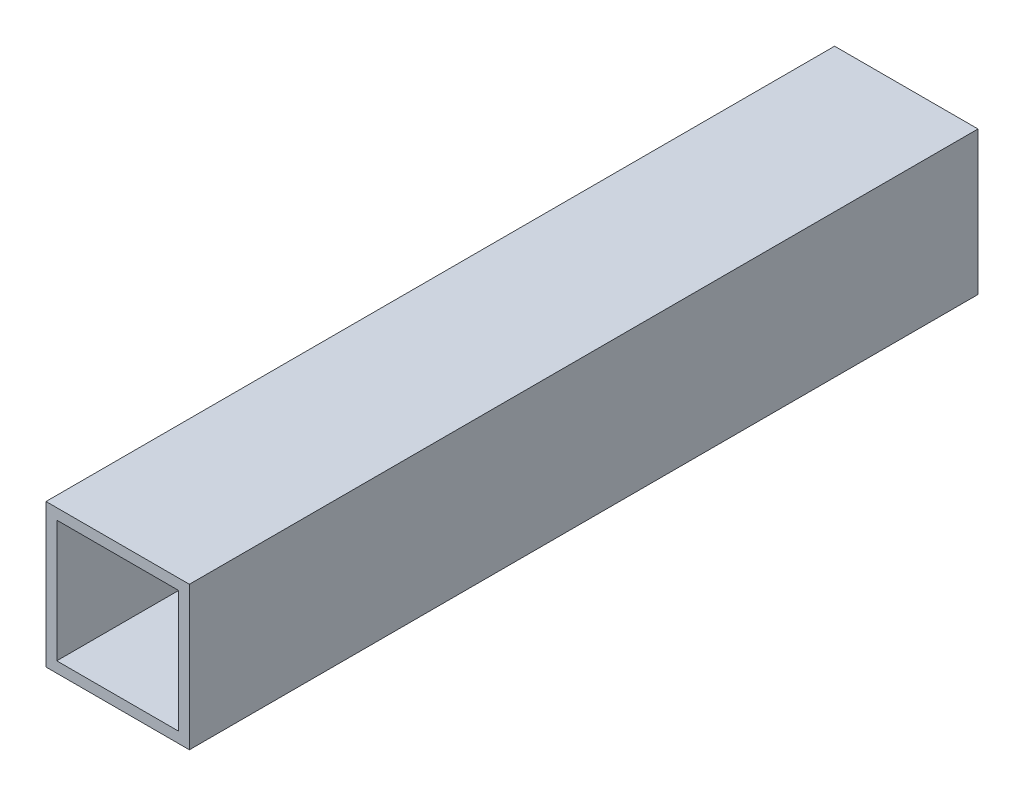
ISO-10303-21;
HEADER;
FILE_DESCRIPTION(('STEP AP214'),'2;1');
FILE_NAME('part.step','',(''),(''),'','','');
FILE_SCHEMA(('AUTOMOTIVE_DESIGN { 1 0 10303 214 1 1 1 1 }'));
ENDSEC;
DATA;
#1=APPLICATION_CONTEXT('core data for automotive mechanical design processes');
#2=APPLICATION_PROTOCOL_DEFINITION('international standard','automotive_design',2000,#1);
#3=PRODUCT_CONTEXT('',#1,'mechanical');
#4=PRODUCT('Part','Part','',(#3));
#5=PRODUCT_RELATED_PRODUCT_CATEGORY('part','',(#4));
#6=PRODUCT_DEFINITION_FORMATION('','',#4);
#7=PRODUCT_DEFINITION_CONTEXT('part definition',#1,'design');
#8=PRODUCT_DEFINITION('design','',#6,#7);
#9=PRODUCT_DEFINITION_SHAPE('','',#8);
#10=(LENGTH_UNIT() NAMED_UNIT(*) SI_UNIT(.MILLI.,.METRE.));
#11=(NAMED_UNIT(*) PLANE_ANGLE_UNIT() SI_UNIT($,.RADIAN.));
#12=(NAMED_UNIT(*) SI_UNIT($,.STERADIAN.) SOLID_ANGLE_UNIT());
#13=UNCERTAINTY_MEASURE_WITH_UNIT(LENGTH_MEASURE(1.E-05),#10,'distance_accuracy_value','');
#14=(GEOMETRIC_REPRESENTATION_CONTEXT(3) GLOBAL_UNCERTAINTY_ASSIGNED_CONTEXT((#13)) GLOBAL_UNIT_ASSIGNED_CONTEXT((#10,
#11,#12)) REPRESENTATION_CONTEXT('',''));
#15=CARTESIAN_POINT('',(0.,0.,0.));
#16=DIRECTION('',(0.,0.,1.));
#17=DIRECTION('',(1.,0.,0.));
#18=AXIS2_PLACEMENT_3D('',#15,#16,#17);
#19=CARTESIAN_POINT('',(0.,0.,220.));
#20=DIRECTION('',(0.,0.,1.));
#21=DIRECTION('',(1.,0.,0.));
#22=AXIS2_PLACEMENT_3D('',#19,#20,#21);
#23=PLANE('',#22);
#24=DIRECTION('',(0.,-1.,0.));
#25=VECTOR('',#24,1.);
#26=CARTESIAN_POINT('',(-20.,-20.,220.));
#27=LINE('',#26,#25);
#28=CARTESIAN_POINT('',(-20.,20.,220.));
#29=VERTEX_POINT('',#28);
#30=CARTESIAN_POINT('',(-20.,-20.,220.));
#31=VERTEX_POINT('',#30);
#32=EDGE_CURVE('E134',#29,#31,#27,.T.);
#33=ORIENTED_EDGE('',*,*,#32,.T.);
#34=DIRECTION('',(1.,0.,0.));
#35=VECTOR('',#34,1.);
#36=CARTESIAN_POINT('',(20.,-20.,220.));
#37=LINE('',#36,#35);
#38=CARTESIAN_POINT('',(20.,-20.,220.));
#39=VERTEX_POINT('',#38);
#40=EDGE_CURVE('E137',#31,#39,#37,.T.);
#41=ORIENTED_EDGE('',*,*,#40,.T.);
#42=DIRECTION('',(0.,1.,0.));
#43=VECTOR('',#42,1.);
#44=CARTESIAN_POINT('',(20.,-20.,220.));
#45=LINE('',#44,#43);
#46=CARTESIAN_POINT('',(20.,20.,220.));
#47=VERTEX_POINT('',#46);
#48=EDGE_CURVE('E140',#39,#47,#45,.T.);
#49=ORIENTED_EDGE('',*,*,#48,.T.);
#50=DIRECTION('',(-1.,0.,0.));
#51=VECTOR('',#50,1.);
#52=CARTESIAN_POINT('',(20.,20.,220.));
#53=LINE('',#52,#51);
#54=EDGE_CURVE('E142',#47,#29,#53,.T.);
#55=ORIENTED_EDGE('',*,*,#54,.T.);
#56=EDGE_LOOP('',(#33,#41,#49,#55));
#57=FACE_BOUND('',#56,.T.);
#58=DIRECTION('',(-1.,0.,0.));
#59=VECTOR('',#58,1.);
#60=CARTESIAN_POINT('',(17.,17.,220.));
#61=LINE('',#60,#59);
#62=CARTESIAN_POINT('',(17.,17.,220.));
#63=VERTEX_POINT('',#62);
#64=CARTESIAN_POINT('',(-17.,17.,220.));
#65=VERTEX_POINT('',#64);
#66=EDGE_CURVE('E106',#63,#65,#61,.T.);
#67=ORIENTED_EDGE('',*,*,#66,.F.);
#68=DIRECTION('',(0.,1.,0.));
#69=VECTOR('',#68,1.);
#70=CARTESIAN_POINT('',(17.,-17.,220.));
#71=LINE('',#70,#69);
#72=CARTESIAN_POINT('',(17.,-17.,220.));
#73=VERTEX_POINT('',#72);
#74=EDGE_CURVE('E98',#73,#63,#71,.T.);
#75=ORIENTED_EDGE('',*,*,#74,.F.);
#76=DIRECTION('',(1.,0.,0.));
#77=VECTOR('',#76,1.);
#78=CARTESIAN_POINT('',(17.,-17.,220.));
#79=LINE('',#78,#77);
#80=CARTESIAN_POINT('',(-17.,-17.,220.));
#81=VERTEX_POINT('',#80);
#82=EDGE_CURVE('E120',#81,#73,#79,.T.);
#83=ORIENTED_EDGE('',*,*,#82,.F.);
#84=DIRECTION('',(0.,-1.,0.));
#85=VECTOR('',#84,1.);
#86=CARTESIAN_POINT('',(-17.,-17.,220.));
#87=LINE('',#86,#85);
#88=EDGE_CURVE('E118',#65,#81,#87,.T.);
#89=ORIENTED_EDGE('',*,*,#88,.F.);
#90=EDGE_LOOP('',(#67,#75,#83,#89));
#91=FACE_BOUND('',#90,.T.);
#92=ADVANCED_FACE('F33',(#57,#91),#23,.T.);
#93=CARTESIAN_POINT('',(0.,0.,0.));
#94=DIRECTION('',(0.,0.,1.));
#95=DIRECTION('',(1.,0.,0.));
#96=AXIS2_PLACEMENT_3D('',#93,#94,#95);
#97=PLANE('',#96);
#98=DIRECTION('',(0.,-1.,0.));
#99=VECTOR('',#98,1.);
#100=CARTESIAN_POINT('',(-20.,-20.,0.));
#101=LINE('',#100,#99);
#102=CARTESIAN_POINT('',(-20.,20.,0.));
#103=VERTEX_POINT('',#102);
#104=CARTESIAN_POINT('',(-20.,-20.,0.));
#105=VERTEX_POINT('',#104);
#106=EDGE_CURVE('E114',#103,#105,#101,.T.);
#107=ORIENTED_EDGE('',*,*,#106,.F.);
#108=DIRECTION('',(-1.,0.,0.));
#109=VECTOR('',#108,1.);
#110=CARTESIAN_POINT('',(20.,20.,0.));
#111=LINE('',#110,#109);
#112=CARTESIAN_POINT('',(20.,20.,0.));
#113=VERTEX_POINT('',#112);
#114=EDGE_CURVE('E138',#113,#103,#111,.T.);
#115=ORIENTED_EDGE('',*,*,#114,.F.);
#116=DIRECTION('',(0.,1.,0.));
#117=VECTOR('',#116,1.);
#118=CARTESIAN_POINT('',(20.,-20.,0.));
#119=LINE('',#118,#117);
#120=CARTESIAN_POINT('',(20.,-20.,0.));
#121=VERTEX_POINT('',#120);
#122=EDGE_CURVE('E149',#121,#113,#119,.T.);
#123=ORIENTED_EDGE('',*,*,#122,.F.);
#124=DIRECTION('',(1.,0.,0.));
#125=VECTOR('',#124,1.);
#126=CARTESIAN_POINT('',(20.,-20.,0.));
#127=LINE('',#126,#125);
#128=EDGE_CURVE('E147',#105,#121,#127,.T.);
#129=ORIENTED_EDGE('',*,*,#128,.F.);
#130=EDGE_LOOP('',(#107,#115,#123,#129));
#131=FACE_BOUND('',#130,.T.);
#132=DIRECTION('',(0.,1.,0.));
#133=VECTOR('',#132,1.);
#134=CARTESIAN_POINT('',(17.,-17.,0.));
#135=LINE('',#134,#133);
#136=CARTESIAN_POINT('',(17.,-17.,0.));
#137=VERTEX_POINT('',#136);
#138=CARTESIAN_POINT('',(17.,17.,0.));
#139=VERTEX_POINT('',#138);
#140=EDGE_CURVE('E56',#137,#139,#135,.T.);
#141=ORIENTED_EDGE('',*,*,#140,.T.);
#142=DIRECTION('',(-1.,0.,0.));
#143=VECTOR('',#142,1.);
#144=CARTESIAN_POINT('',(17.,17.,0.));
#145=LINE('',#144,#143);
#146=CARTESIAN_POINT('',(-17.,17.,0.));
#147=VERTEX_POINT('',#146);
#148=EDGE_CURVE('E113',#139,#147,#145,.T.);
#149=ORIENTED_EDGE('',*,*,#148,.T.);
#150=DIRECTION('',(0.,-1.,0.));
#151=VECTOR('',#150,1.);
#152=CARTESIAN_POINT('',(-17.,-17.,0.));
#153=LINE('',#152,#151);
#154=CARTESIAN_POINT('',(-17.,-17.,0.));
#155=VERTEX_POINT('',#154);
#156=EDGE_CURVE('E126',#147,#155,#153,.T.);
#157=ORIENTED_EDGE('',*,*,#156,.T.);
#158=DIRECTION('',(1.,0.,0.));
#159=VECTOR('',#158,1.);
#160=CARTESIAN_POINT('',(17.,-17.,0.));
#161=LINE('',#160,#159);
#162=EDGE_CURVE('E107',#155,#137,#161,.T.);
#163=ORIENTED_EDGE('',*,*,#162,.T.);
#164=EDGE_LOOP('',(#141,#149,#157,#163));
#165=FACE_BOUND('',#164,.T.);
#166=ADVANCED_FACE('F167',(#131,#165),#97,.F.);
#167=CARTESIAN_POINT('',(-20.,-20.,220.));
#168=DIRECTION('',(1.,0.,0.));
#169=DIRECTION('',(0.,0.,-1.));
#170=AXIS2_PLACEMENT_3D('',#167,#168,#169);
#171=PLANE('',#170);
#172=ORIENTED_EDGE('',*,*,#106,.T.);
#173=DIRECTION('',(0.,0.,-1.));
#174=VECTOR('',#173,1.);
#175=CARTESIAN_POINT('',(-20.,-20.,220.));
#176=LINE('',#175,#174);
#177=EDGE_CURVE('E11',#31,#105,#176,.T.);
#178=ORIENTED_EDGE('',*,*,#177,.F.);
#179=ORIENTED_EDGE('',*,*,#32,.F.);
#180=DIRECTION('',(0.,0.,-1.));
#181=VECTOR('',#180,1.);
#182=CARTESIAN_POINT('',(-20.,20.,220.));
#183=LINE('',#182,#181);
#184=EDGE_CURVE('E144',#29,#103,#183,.T.);
#185=ORIENTED_EDGE('',*,*,#184,.T.);
#186=EDGE_LOOP('',(#172,#178,#179,#185));
#187=FACE_BOUND('',#186,.T.);
#188=ADVANCED_FACE('F35',(#187),#171,.F.);
#189=CARTESIAN_POINT('',(20.,-20.,220.));
#190=DIRECTION('',(0.,1.,0.));
#191=DIRECTION('',(-1.,0.,0.));
#192=AXIS2_PLACEMENT_3D('',#189,#190,#191);
#193=PLANE('',#192);
#194=ORIENTED_EDGE('',*,*,#128,.T.);
#195=DIRECTION('',(0.,0.,-1.));
#196=VECTOR('',#195,1.);
#197=CARTESIAN_POINT('',(20.,-20.,220.));
#198=LINE('',#197,#196);
#199=EDGE_CURVE('E41',#39,#121,#198,.T.);
#200=ORIENTED_EDGE('',*,*,#199,.F.);
#201=ORIENTED_EDGE('',*,*,#40,.F.);
#202=ORIENTED_EDGE('',*,*,#177,.T.);
#203=EDGE_LOOP('',(#194,#200,#201,#202));
#204=FACE_BOUND('',#203,.T.);
#205=ADVANCED_FACE('F177',(#204),#193,.F.);
#206=CARTESIAN_POINT('',(20.,-20.,220.));
#207=DIRECTION('',(-1.,0.,0.));
#208=DIRECTION('',(0.,0.,1.));
#209=AXIS2_PLACEMENT_3D('',#206,#207,#208);
#210=PLANE('',#209);
#211=ORIENTED_EDGE('',*,*,#122,.T.);
#212=DIRECTION('',(0.,0.,-1.));
#213=VECTOR('',#212,1.);
#214=CARTESIAN_POINT('',(20.,20.,220.));
#215=LINE('',#214,#213);
#216=EDGE_CURVE('E154',#47,#113,#215,.T.);
#217=ORIENTED_EDGE('',*,*,#216,.F.);
#218=ORIENTED_EDGE('',*,*,#48,.F.);
#219=ORIENTED_EDGE('',*,*,#199,.T.);
#220=EDGE_LOOP('',(#211,#217,#218,#219));
#221=FACE_BOUND('',#220,.T.);
#222=ADVANCED_FACE('F161',(#221),#210,.F.);
#223=CARTESIAN_POINT('',(20.,20.,220.));
#224=DIRECTION('',(0.,-1.,0.));
#225=DIRECTION('',(1.,0.,0.));
#226=AXIS2_PLACEMENT_3D('',#223,#224,#225);
#227=PLANE('',#226);
#228=ORIENTED_EDGE('',*,*,#114,.T.);
#229=ORIENTED_EDGE('',*,*,#184,.F.);
#230=ORIENTED_EDGE('',*,*,#54,.F.);
#231=ORIENTED_EDGE('',*,*,#216,.T.);
#232=EDGE_LOOP('',(#228,#229,#230,#231));
#233=FACE_BOUND('',#232,.T.);
#234=ADVANCED_FACE('F171',(#233),#227,.F.);
#235=CARTESIAN_POINT('',(17.,-17.,220.));
#236=DIRECTION('',(-1.,0.,0.));
#237=DIRECTION('',(0.,0.,1.));
#238=AXIS2_PLACEMENT_3D('',#235,#236,#237);
#239=PLANE('',#238);
#240=ORIENTED_EDGE('',*,*,#140,.F.);
#241=DIRECTION('',(0.,0.,-1.));
#242=VECTOR('',#241,1.);
#243=CARTESIAN_POINT('',(17.,-17.,220.));
#244=LINE('',#243,#242);
#245=EDGE_CURVE('E102',#73,#137,#244,.T.);
#246=ORIENTED_EDGE('',*,*,#245,.F.);
#247=ORIENTED_EDGE('',*,*,#74,.T.);
#248=DIRECTION('',(0.,0.,-1.));
#249=VECTOR('',#248,1.);
#250=CARTESIAN_POINT('',(17.,17.,220.));
#251=LINE('',#250,#249);
#252=EDGE_CURVE('E101',#63,#139,#251,.T.);
#253=ORIENTED_EDGE('',*,*,#252,.T.);
#254=EDGE_LOOP('',(#240,#246,#247,#253));
#255=FACE_BOUND('',#254,.T.);
#256=ADVANCED_FACE('F100',(#255),#239,.T.);
#257=CARTESIAN_POINT('',(17.,17.,220.));
#258=DIRECTION('',(0.,-1.,0.));
#259=DIRECTION('',(1.,0.,0.));
#260=AXIS2_PLACEMENT_3D('',#257,#258,#259);
#261=PLANE('',#260);
#262=ORIENTED_EDGE('',*,*,#148,.F.);
#263=ORIENTED_EDGE('',*,*,#252,.F.);
#264=ORIENTED_EDGE('',*,*,#66,.T.);
#265=DIRECTION('',(0.,0.,-1.));
#266=VECTOR('',#265,1.);
#267=CARTESIAN_POINT('',(-17.,17.,220.));
#268=LINE('',#267,#266);
#269=EDGE_CURVE('E115',#65,#147,#268,.T.);
#270=ORIENTED_EDGE('',*,*,#269,.T.);
#271=EDGE_LOOP('',(#262,#263,#264,#270));
#272=FACE_BOUND('',#271,.T.);
#273=ADVANCED_FACE('F110',(#272),#261,.T.);
#274=CARTESIAN_POINT('',(-17.,-17.,220.));
#275=DIRECTION('',(1.,0.,0.));
#276=DIRECTION('',(0.,1.,0.));
#277=AXIS2_PLACEMENT_3D('',#274,#275,#276);
#278=PLANE('',#277);
#279=ORIENTED_EDGE('',*,*,#156,.F.);
#280=ORIENTED_EDGE('',*,*,#269,.F.);
#281=ORIENTED_EDGE('',*,*,#88,.T.);
#282=DIRECTION('',(0.,0.,-1.));
#283=VECTOR('',#282,1.);
#284=CARTESIAN_POINT('',(-17.,-17.,220.));
#285=LINE('',#284,#283);
#286=EDGE_CURVE('E48',#81,#155,#285,.T.);
#287=ORIENTED_EDGE('',*,*,#286,.T.);
#288=EDGE_LOOP('',(#279,#280,#281,#287));
#289=FACE_BOUND('',#288,.T.);
#290=ADVANCED_FACE('F200',(#289),#278,.T.);
#291=CARTESIAN_POINT('',(17.,-17.,220.));
#292=DIRECTION('',(0.,1.,0.));
#293=DIRECTION('',(0.,0.,1.));
#294=AXIS2_PLACEMENT_3D('',#291,#292,#293);
#295=PLANE('',#294);
#296=ORIENTED_EDGE('',*,*,#162,.F.);
#297=ORIENTED_EDGE('',*,*,#286,.F.);
#298=ORIENTED_EDGE('',*,*,#82,.T.);
#299=ORIENTED_EDGE('',*,*,#245,.T.);
#300=EDGE_LOOP('',(#296,#297,#298,#299));
#301=FACE_BOUND('',#300,.T.);
#302=ADVANCED_FACE('F204',(#301),#295,.T.);
#303=CLOSED_SHELL('',(#92,#166,#188,#205,#222,#234,#256,#273,#290,#302));
#304=MANIFOLD_SOLID_BREP('B2',#303);
#305=ADVANCED_BREP_SHAPE_REPRESENTATION('',(#18,#304),#14);
#306=SHAPE_DEFINITION_REPRESENTATION(#9,#305);
ENDSEC;
END-ISO-10303-21;
